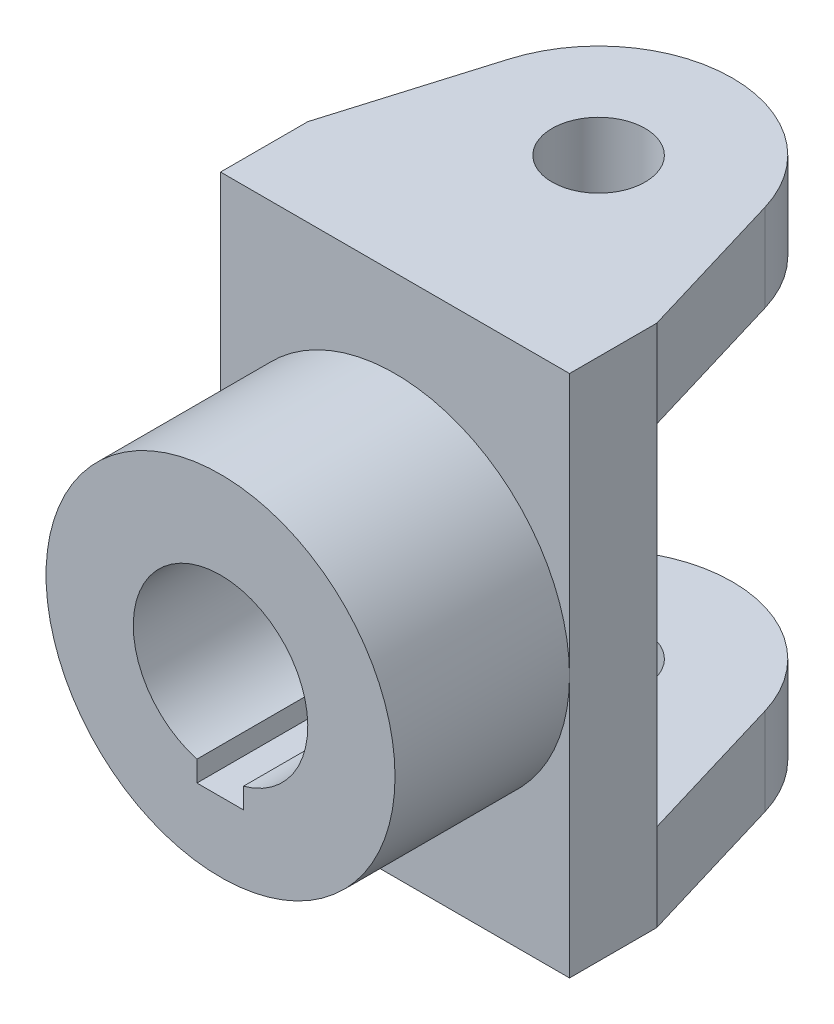
ISO-10303-21;
HEADER;
FILE_DESCRIPTION(('STEP AP214'),'2;1');
FILE_NAME('part.step','',(''),(''),'','','');
FILE_SCHEMA(('AUTOMOTIVE_DESIGN { 1 0 10303 214 1 1 1 1 }'));
ENDSEC;
DATA;
#1=APPLICATION_CONTEXT('core data for automotive mechanical design processes');
#2=APPLICATION_PROTOCOL_DEFINITION('international standard','automotive_design',2000,#1);
#3=PRODUCT_CONTEXT('',#1,'mechanical');
#4=PRODUCT('Part','Part','',(#3));
#5=PRODUCT_RELATED_PRODUCT_CATEGORY('part','',(#4));
#6=PRODUCT_DEFINITION_FORMATION('','',#4);
#7=PRODUCT_DEFINITION_CONTEXT('part definition',#1,'design');
#8=PRODUCT_DEFINITION('design','',#6,#7);
#9=PRODUCT_DEFINITION_SHAPE('','',#8);
#10=(LENGTH_UNIT() NAMED_UNIT(*) SI_UNIT(.MILLI.,.METRE.));
#11=(NAMED_UNIT(*) PLANE_ANGLE_UNIT() SI_UNIT($,.RADIAN.));
#12=(NAMED_UNIT(*) SI_UNIT($,.STERADIAN.) SOLID_ANGLE_UNIT());
#13=UNCERTAINTY_MEASURE_WITH_UNIT(LENGTH_MEASURE(1.E-05),#10,'distance_accuracy_value','');
#14=(GEOMETRIC_REPRESENTATION_CONTEXT(3) GLOBAL_UNCERTAINTY_ASSIGNED_CONTEXT((#13)) GLOBAL_UNIT_ASSIGNED_CONTEXT((#10,
#11,#12)) REPRESENTATION_CONTEXT('',''));
#15=CARTESIAN_POINT('',(0.,0.,0.));
#16=DIRECTION('',(0.,0.,1.));
#17=DIRECTION('',(1.,0.,0.));
#18=AXIS2_PLACEMENT_3D('',#15,#16,#17);
#19=CARTESIAN_POINT('',(0.,0.,0.));
#20=DIRECTION('',(0.,0.,-1.));
#21=DIRECTION('',(-1.,0.,0.));
#22=AXIS2_PLACEMENT_3D('',#19,#20,#21);
#23=PLANE('',#22);
#24=DIRECTION('',(0.,1.,0.));
#25=VECTOR('',#24,1.);
#26=CARTESIAN_POINT('',(30.,-45.,0.));
#27=LINE('',#26,#25);
#28=CARTESIAN_POINT('',(30.,-30.,0.));
#29=VERTEX_POINT('',#28);
#30=CARTESIAN_POINT('',(30.,30.,0.));
#31=VERTEX_POINT('',#30);
#32=EDGE_CURVE('E41',#29,#31,#27,.T.);
#33=ORIENTED_EDGE('',*,*,#32,.F.);
#34=DIRECTION('',(1.,0.,0.));
#35=VECTOR('',#34,1.);
#36=CARTESIAN_POINT('',(-30.,-30.,0.));
#37=LINE('',#36,#35);
#38=CARTESIAN_POINT('',(-30.,-30.,0.));
#39=VERTEX_POINT('',#38);
#40=EDGE_CURVE('E170',#39,#29,#37,.T.);
#41=ORIENTED_EDGE('',*,*,#40,.F.);
#42=DIRECTION('',(0.,-1.,0.));
#43=VECTOR('',#42,1.);
#44=CARTESIAN_POINT('',(-30.,-45.,0.));
#45=LINE('',#44,#43);
#46=CARTESIAN_POINT('',(-30.,30.,0.));
#47=VERTEX_POINT('',#46);
#48=EDGE_CURVE('E290',#47,#39,#45,.T.);
#49=ORIENTED_EDGE('',*,*,#48,.F.);
#50=DIRECTION('',(1.,0.,0.));
#51=VECTOR('',#50,1.);
#52=CARTESIAN_POINT('',(-30.,30.,0.));
#53=LINE('',#52,#51);
#54=EDGE_CURVE('E203',#47,#31,#53,.T.);
#55=ORIENTED_EDGE('',*,*,#54,.T.);
#56=EDGE_LOOP('',(#33,#41,#49,#55));
#57=FACE_BOUND('',#56,.T.);
#58=ADVANCED_FACE('F37',(#57),#23,.T.);
#59=CARTESIAN_POINT('',(0.,0.,15.));
#60=DIRECTION('',(0.,0.,-1.));
#61=DIRECTION('',(-1.,0.,0.));
#62=AXIS2_PLACEMENT_3D('',#59,#60,#61);
#63=PLANE('',#62);
#64=CARTESIAN_POINT('',(0.,0.,15.));
#65=DIRECTION('',(0.,0.,1.));
#66=DIRECTION('',(1.,0.,0.));
#67=AXIS2_PLACEMENT_3D('',#64,#65,#66);
#68=CIRCLE('',#67,30.);
#69=CARTESIAN_POINT('',(30.,0.,15.));
#70=VERTEX_POINT('',#69);
#71=CARTESIAN_POINT('',(-30.,0.,15.));
#72=VERTEX_POINT('',#71);
#73=EDGE_CURVE('E49',#70,#72,#68,.T.);
#74=ORIENTED_EDGE('',*,*,#73,.F.);
#75=DIRECTION('',(0.,1.,0.));
#76=VECTOR('',#75,1.);
#77=CARTESIAN_POINT('',(30.,-45.,15.));
#78=LINE('',#77,#76);
#79=CARTESIAN_POINT('',(30.,45.,15.));
#80=VERTEX_POINT('',#79);
#81=EDGE_CURVE('E275',#70,#80,#78,.T.);
#82=ORIENTED_EDGE('',*,*,#81,.T.);
#83=DIRECTION('',(-1.,0.,0.));
#84=VECTOR('',#83,1.);
#85=CARTESIAN_POINT('',(-30.,45.,15.));
#86=LINE('',#85,#84);
#87=CARTESIAN_POINT('',(-30.,45.,15.));
#88=VERTEX_POINT('',#87);
#89=EDGE_CURVE('E274',#80,#88,#86,.T.);
#90=ORIENTED_EDGE('',*,*,#89,.T.);
#91=DIRECTION('',(0.,-1.,0.));
#92=VECTOR('',#91,1.);
#93=CARTESIAN_POINT('',(-30.,-45.,15.));
#94=LINE('',#93,#92);
#95=EDGE_CURVE('E278',#88,#72,#94,.T.);
#96=ORIENTED_EDGE('',*,*,#95,.T.);
#97=EDGE_LOOP('',(#74,#82,#90,#96));
#98=FACE_BOUND('',#97,.T.);
#99=ADVANCED_FACE('F300',(#98),#63,.F.);
#100=EDGE_CURVE('E11',#72,#70,#68,.T.);
#101=ORIENTED_EDGE('',*,*,#100,.F.);
#102=CARTESIAN_POINT('',(-30.,-45.,15.));
#103=VERTEX_POINT('',#102);
#104=EDGE_CURVE('E277',#72,#103,#94,.T.);
#105=ORIENTED_EDGE('',*,*,#104,.T.);
#106=DIRECTION('',(1.,0.,0.));
#107=VECTOR('',#106,1.);
#108=CARTESIAN_POINT('',(-30.,-45.,15.));
#109=LINE('',#108,#107);
#110=CARTESIAN_POINT('',(30.,-45.,15.));
#111=VERTEX_POINT('',#110);
#112=EDGE_CURVE('E281',#103,#111,#109,.T.);
#113=ORIENTED_EDGE('',*,*,#112,.T.);
#114=EDGE_CURVE('E272',#111,#70,#78,.T.);
#115=ORIENTED_EDGE('',*,*,#114,.T.);
#116=EDGE_LOOP('',(#101,#105,#113,#115));
#117=FACE_BOUND('',#116,.T.);
#118=ADVANCED_FACE('F344',(#117),#63,.F.);
#119=CARTESIAN_POINT('',(30.,-45.,15.));
#120=DIRECTION('',(-1.,0.,0.));
#121=DIRECTION('',(0.,0.,1.));
#122=AXIS2_PLACEMENT_3D('',#119,#120,#121);
#123=PLANE('',#122);
#124=CARTESIAN_POINT('',(30.,-45.,0.));
#125=VERTEX_POINT('',#124);
#126=EDGE_CURVE('E288',#125,#29,#27,.T.);
#127=ORIENTED_EDGE('',*,*,#126,.T.);
#128=ORIENTED_EDGE('',*,*,#32,.T.);
#129=DIRECTION('',(0.,1.,0.));
#130=VECTOR('',#129,1.);
#131=CARTESIAN_POINT('',(30.,30.,0.));
#132=LINE('',#131,#130);
#133=CARTESIAN_POINT('',(30.,45.,0.));
#134=VERTEX_POINT('',#133);
#135=EDGE_CURVE('E216',#31,#134,#132,.T.);
#136=ORIENTED_EDGE('',*,*,#135,.T.);
#137=DIRECTION('',(0.,0.,-1.));
#138=VECTOR('',#137,1.);
#139=CARTESIAN_POINT('',(30.,45.,15.));
#140=LINE('',#139,#138);
#141=EDGE_CURVE('E47',#80,#134,#140,.T.);
#142=ORIENTED_EDGE('',*,*,#141,.F.);
#143=ORIENTED_EDGE('',*,*,#81,.F.);
#144=ORIENTED_EDGE('',*,*,#114,.F.);
#145=DIRECTION('',(0.,0.,-1.));
#146=VECTOR('',#145,1.);
#147=CARTESIAN_POINT('',(30.,-45.,15.));
#148=LINE('',#147,#146);
#149=EDGE_CURVE('E282',#111,#125,#148,.T.);
#150=ORIENTED_EDGE('',*,*,#149,.T.);
#151=EDGE_LOOP('',(#127,#128,#136,#142,#143,#144,#150));
#152=FACE_BOUND('',#151,.T.);
#153=ADVANCED_FACE('F39',(#152),#123,.F.);
#154=CARTESIAN_POINT('',(-30.,45.,15.));
#155=DIRECTION('',(0.,-1.,0.));
#156=DIRECTION('',(0.,0.,-1.));
#157=AXIS2_PLACEMENT_3D('',#154,#155,#156);
#158=PLANE('',#157);
#159=ORIENTED_EDGE('',*,*,#141,.T.);
#160=DIRECTION('',(-0.286928155857607,0.,-0.957952103905071));
#161=VECTOR('',#160,1.);
#162=CARTESIAN_POINT('',(30.,45.,0.));
#163=LINE('',#162,#161);
#164=CARTESIAN_POINT('',(22.0328983898166,45.,-26.599347584725));
#165=VERTEX_POINT('',#164);
#166=EDGE_CURVE('E228',#134,#165,#163,.T.);
#167=ORIENTED_EDGE('',*,*,#166,.T.);
#168=CARTESIAN_POINT('',(0.,45.,-20.));
#169=DIRECTION('',(0.,1.,0.));
#170=DIRECTION('',(0.,0.,1.));
#171=AXIS2_PLACEMENT_3D('',#168,#169,#170);
#172=CIRCLE('',#171,23.);
#173=CARTESIAN_POINT('',(-22.0328983898166,45.,-26.599347584725));
#174=VERTEX_POINT('',#173);
#175=EDGE_CURVE('E222',#165,#174,#172,.T.);
#176=ORIENTED_EDGE('',*,*,#175,.T.);
#177=DIRECTION('',(-0.286928155857607,0.,0.957952103905072));
#178=VECTOR('',#177,1.);
#179=CARTESIAN_POINT('',(-30.,45.,0.));
#180=LINE('',#179,#178);
#181=CARTESIAN_POINT('',(-30.,45.,0.));
#182=VERTEX_POINT('',#181);
#183=EDGE_CURVE('E195',#174,#182,#180,.T.);
#184=ORIENTED_EDGE('',*,*,#183,.T.);
#185=DIRECTION('',(0.,0.,-1.));
#186=VECTOR('',#185,1.);
#187=CARTESIAN_POINT('',(-30.,45.,15.));
#188=LINE('',#187,#186);
#189=EDGE_CURVE('E307',#88,#182,#188,.T.);
#190=ORIENTED_EDGE('',*,*,#189,.F.);
#191=ORIENTED_EDGE('',*,*,#89,.F.);
#192=EDGE_LOOP('',(#159,#167,#176,#184,#190,#191));
#193=FACE_BOUND('',#192,.T.);
#194=CARTESIAN_POINT('',(0.,45.,-20.));
#195=DIRECTION('',(0.,1.,0.));
#196=DIRECTION('',(0.,0.,1.));
#197=AXIS2_PLACEMENT_3D('',#194,#195,#196);
#198=CIRCLE('',#197,8.);
#199=CARTESIAN_POINT('',(0.,45.,-12.));
#200=VERTEX_POINT('',#199);
#201=EDGE_CURVE('E190',#200,#200,#198,.T.);
#202=ORIENTED_EDGE('',*,*,#201,.F.);
#203=EDGE_LOOP('',(#202));
#204=FACE_BOUND('',#203,.T.);
#205=ADVANCED_FACE('F305',(#193,#204),#158,.F.);
#206=CARTESIAN_POINT('',(-30.,-45.,15.));
#207=DIRECTION('',(1.,0.,0.));
#208=DIRECTION('',(0.,0.,-1.));
#209=AXIS2_PLACEMENT_3D('',#206,#207,#208);
#210=PLANE('',#209);
#211=EDGE_CURVE('E209',#182,#47,#45,.T.);
#212=ORIENTED_EDGE('',*,*,#211,.T.);
#213=ORIENTED_EDGE('',*,*,#48,.T.);
#214=DIRECTION('',(0.,-1.,0.));
#215=VECTOR('',#214,1.);
#216=CARTESIAN_POINT('',(-30.,-30.,0.));
#217=LINE('',#216,#215);
#218=CARTESIAN_POINT('',(-30.,-45.,0.));
#219=VERTEX_POINT('',#218);
#220=EDGE_CURVE('E174',#39,#219,#217,.T.);
#221=ORIENTED_EDGE('',*,*,#220,.T.);
#222=DIRECTION('',(0.,0.,-1.));
#223=VECTOR('',#222,1.);
#224=CARTESIAN_POINT('',(-30.,-45.,15.));
#225=LINE('',#224,#223);
#226=EDGE_CURVE('E310',#103,#219,#225,.T.);
#227=ORIENTED_EDGE('',*,*,#226,.F.);
#228=ORIENTED_EDGE('',*,*,#104,.F.);
#229=ORIENTED_EDGE('',*,*,#95,.F.);
#230=ORIENTED_EDGE('',*,*,#189,.T.);
#231=EDGE_LOOP('',(#212,#213,#221,#227,#228,#229,#230));
#232=FACE_BOUND('',#231,.T.);
#233=ADVANCED_FACE('F357',(#232),#210,.F.);
#234=CARTESIAN_POINT('',(-30.,-45.,15.));
#235=DIRECTION('',(0.,1.,0.));
#236=DIRECTION('',(0.,0.,1.));
#237=AXIS2_PLACEMENT_3D('',#234,#235,#236);
#238=PLANE('',#237);
#239=ORIENTED_EDGE('',*,*,#226,.T.);
#240=DIRECTION('',(-0.286928155857607,0.,0.957952103905072));
#241=VECTOR('',#240,1.);
#242=CARTESIAN_POINT('',(-30.,-45.,0.));
#243=LINE('',#242,#241);
#244=CARTESIAN_POINT('',(-22.0328983898166,-45.,-26.599347584725));
#245=VERTEX_POINT('',#244);
#246=EDGE_CURVE('E185',#245,#219,#243,.T.);
#247=ORIENTED_EDGE('',*,*,#246,.F.);
#248=CARTESIAN_POINT('',(0.,-45.,-20.));
#249=DIRECTION('',(0.,1.,0.));
#250=DIRECTION('',(0.,0.,1.));
#251=AXIS2_PLACEMENT_3D('',#248,#249,#250);
#252=CIRCLE('',#251,23.);
#253=CARTESIAN_POINT('',(22.0328983898166,-45.,-26.599347584725));
#254=VERTEX_POINT('',#253);
#255=EDGE_CURVE('E166',#254,#245,#252,.T.);
#256=ORIENTED_EDGE('',*,*,#255,.F.);
#257=DIRECTION('',(-0.286928155857607,0.,-0.957952103905071));
#258=VECTOR('',#257,1.);
#259=CARTESIAN_POINT('',(30.,-45.,0.));
#260=LINE('',#259,#258);
#261=EDGE_CURVE('E176',#125,#254,#260,.T.);
#262=ORIENTED_EDGE('',*,*,#261,.F.);
#263=ORIENTED_EDGE('',*,*,#149,.F.);
#264=ORIENTED_EDGE('',*,*,#112,.F.);
#265=EDGE_LOOP('',(#239,#247,#256,#262,#263,#264));
#266=FACE_BOUND('',#265,.T.);
#267=CARTESIAN_POINT('',(0.,-45.,-20.));
#268=DIRECTION('',(0.,1.,0.));
#269=DIRECTION('',(0.,0.,1.));
#270=AXIS2_PLACEMENT_3D('',#267,#268,#269);
#271=CIRCLE('',#270,8.);
#272=CARTESIAN_POINT('',(0.,-45.,-12.));
#273=VERTEX_POINT('',#272);
#274=EDGE_CURVE('E180',#273,#273,#271,.T.);
#275=ORIENTED_EDGE('',*,*,#274,.T.);
#276=EDGE_LOOP('',(#275));
#277=FACE_BOUND('',#276,.T.);
#278=ADVANCED_FACE('F318',(#266,#277),#238,.F.);
#279=CARTESIAN_POINT('',(0.,0.,45.));
#280=DIRECTION('',(0.,0.,1.));
#281=DIRECTION('',(1.,0.,0.));
#282=AXIS2_PLACEMENT_3D('',#279,#280,#281);
#283=PLANE('',#282);
#284=CARTESIAN_POINT('',(0.,0.,45.));
#285=DIRECTION('',(0.,0.,1.));
#286=DIRECTION('',(1.,0.,0.));
#287=AXIS2_PLACEMENT_3D('',#284,#285,#286);
#288=CIRCLE('',#287,30.);
#289=CARTESIAN_POINT('',(30.,0.,45.));
#290=VERTEX_POINT('',#289);
#291=EDGE_CURVE('E268',#290,#290,#288,.T.);
#292=ORIENTED_EDGE('',*,*,#291,.T.);
#293=EDGE_LOOP('',(#292));
#294=FACE_BOUND('',#293,.T.);
#295=DIRECTION('',(0.,1.,0.));
#296=VECTOR('',#295,1.);
#297=CARTESIAN_POINT('',(3.94187726838371,-14.4727883837566,45.));
#298=LINE('',#297,#296);
#299=CARTESIAN_POINT('',(3.94187726838371,-17.9998873911796,45.));
#300=VERTEX_POINT('',#299);
#301=CARTESIAN_POINT('',(3.94187726838371,-14.4727883837566,45.));
#302=VERTEX_POINT('',#301);
#303=EDGE_CURVE('E242',#300,#302,#298,.T.);
#304=ORIENTED_EDGE('',*,*,#303,.F.);
#305=DIRECTION('',(1.,0.,0.));
#306=VECTOR('',#305,1.);
#307=CARTESIAN_POINT('',(-4.0581227316163,-17.9998873911796,45.));
#308=LINE('',#307,#306);
#309=CARTESIAN_POINT('',(-4.0581227316163,-17.9998873911796,45.));
#310=VERTEX_POINT('',#309);
#311=EDGE_CURVE('E240',#310,#300,#308,.T.);
#312=ORIENTED_EDGE('',*,*,#311,.F.);
#313=DIRECTION('',(0.,-1.,0.));
#314=VECTOR('',#313,1.);
#315=CARTESIAN_POINT('',(-4.0581227316163,-14.4406246365986,45.));
#316=LINE('',#315,#314);
#317=CARTESIAN_POINT('',(-4.0581227316163,-14.4406246365986,45.));
#318=VERTEX_POINT('',#317);
#319=EDGE_CURVE('E248',#318,#310,#316,.T.);
#320=ORIENTED_EDGE('',*,*,#319,.F.);
#321=CARTESIAN_POINT('',(0.,0.,45.));
#322=DIRECTION('',(0.,0.,1.));
#323=DIRECTION('',(1.,0.,0.));
#324=AXIS2_PLACEMENT_3D('',#321,#322,#323);
#325=CIRCLE('',#324,15.);
#326=EDGE_CURVE('E245',#302,#318,#325,.T.);
#327=ORIENTED_EDGE('',*,*,#326,.F.);
#328=EDGE_LOOP('',(#304,#312,#320,#327));
#329=FACE_BOUND('',#328,.T.);
#330=ADVANCED_FACE('F356',(#294,#329),#283,.T.);
#331=CARTESIAN_POINT('',(0.,0.,45.));
#332=DIRECTION('',(0.,0.,-1.));
#333=DIRECTION('',(-1.,0.,0.));
#334=AXIS2_PLACEMENT_3D('',#331,#332,#333);
#335=CYLINDRICAL_SURFACE('',#334,30.);
#336=ORIENTED_EDGE('',*,*,#291,.F.);
#337=EDGE_LOOP('',(#336));
#338=FACE_BOUND('',#337,.T.);
#339=ORIENTED_EDGE('',*,*,#73,.T.);
#340=ORIENTED_EDGE('',*,*,#100,.T.);
#341=EDGE_LOOP('',(#339,#340));
#342=FACE_BOUND('',#341,.T.);
#343=ADVANCED_FACE('F372',(#338,#342),#335,.T.);
#344=CARTESIAN_POINT('',(-4.0581227316163,-17.9998873911796,45.));
#345=DIRECTION('',(0.,1.,0.));
#346=DIRECTION('',(0.,0.,1.));
#347=AXIS2_PLACEMENT_3D('',#344,#345,#346);
#348=PLANE('',#347);
#349=DIRECTION('',(1.,0.,0.));
#350=VECTOR('',#349,1.);
#351=CARTESIAN_POINT('',(-4.0581227316163,-17.9998873911796,15.));
#352=LINE('',#351,#350);
#353=CARTESIAN_POINT('',(-4.0581227316163,-17.9998873911796,15.));
#354=VERTEX_POINT('',#353);
#355=CARTESIAN_POINT('',(3.94187726838371,-17.9998873911796,15.));
#356=VERTEX_POINT('',#355);
#357=EDGE_CURVE('E238',#354,#356,#352,.T.);
#358=ORIENTED_EDGE('',*,*,#357,.F.);
#359=DIRECTION('',(0.,0.,-1.));
#360=VECTOR('',#359,1.);
#361=CARTESIAN_POINT('',(-4.0581227316163,-17.9998873911796,45.));
#362=LINE('',#361,#360);
#363=EDGE_CURVE('E63',#310,#354,#362,.T.);
#364=ORIENTED_EDGE('',*,*,#363,.F.);
#365=ORIENTED_EDGE('',*,*,#311,.T.);
#366=DIRECTION('',(0.,0.,-1.));
#367=VECTOR('',#366,1.);
#368=CARTESIAN_POINT('',(3.94187726838371,-17.9998873911796,45.));
#369=LINE('',#368,#367);
#370=EDGE_CURVE('E265',#300,#356,#369,.T.);
#371=ORIENTED_EDGE('',*,*,#370,.T.);
#372=EDGE_LOOP('',(#358,#364,#365,#371));
#373=FACE_BOUND('',#372,.T.);
#374=ADVANCED_FACE('F374',(#373),#348,.T.);
#375=CARTESIAN_POINT('',(3.94187726838371,-14.4727883837566,45.));
#376=DIRECTION('',(-1.,0.,0.));
#377=DIRECTION('',(0.,-1.,0.));
#378=AXIS2_PLACEMENT_3D('',#375,#376,#377);
#379=PLANE('',#378);
#380=DIRECTION('',(0.,1.,0.));
#381=VECTOR('',#380,1.);
#382=CARTESIAN_POINT('',(3.94187726838371,-14.4727883837566,15.));
#383=LINE('',#382,#381);
#384=CARTESIAN_POINT('',(3.94187726838371,-14.4727883837566,15.));
#385=VERTEX_POINT('',#384);
#386=EDGE_CURVE('E252',#356,#385,#383,.T.);
#387=ORIENTED_EDGE('',*,*,#386,.F.);
#388=ORIENTED_EDGE('',*,*,#370,.F.);
#389=ORIENTED_EDGE('',*,*,#303,.T.);
#390=DIRECTION('',(0.,0.,-1.));
#391=VECTOR('',#390,1.);
#392=CARTESIAN_POINT('',(3.94187726838371,-14.4727883837566,45.));
#393=LINE('',#392,#391);
#394=EDGE_CURVE('E263',#302,#385,#393,.T.);
#395=ORIENTED_EDGE('',*,*,#394,.T.);
#396=EDGE_LOOP('',(#387,#388,#389,#395));
#397=FACE_BOUND('',#396,.T.);
#398=ADVANCED_FACE('F380',(#397),#379,.T.);
#399=CARTESIAN_POINT('',(0.,0.,45.));
#400=DIRECTION('',(0.,0.,-1.));
#401=DIRECTION('',(-1.,0.,0.));
#402=AXIS2_PLACEMENT_3D('',#399,#400,#401);
#403=CYLINDRICAL_SURFACE('',#402,15.);
#404=CARTESIAN_POINT('',(0.,0.,15.));
#405=DIRECTION('',(0.,0.,1.));
#406=DIRECTION('',(1.,0.,0.));
#407=AXIS2_PLACEMENT_3D('',#404,#405,#406);
#408=CIRCLE('',#407,15.);
#409=CARTESIAN_POINT('',(-4.0581227316163,-14.4406246365986,15.));
#410=VERTEX_POINT('',#409);
#411=EDGE_CURVE('E255',#385,#410,#408,.T.);
#412=ORIENTED_EDGE('',*,*,#411,.F.);
#413=ORIENTED_EDGE('',*,*,#394,.F.);
#414=ORIENTED_EDGE('',*,*,#326,.T.);
#415=DIRECTION('',(0.,0.,-1.));
#416=VECTOR('',#415,1.);
#417=CARTESIAN_POINT('',(-4.0581227316163,-14.4406246365986,45.));
#418=LINE('',#417,#416);
#419=EDGE_CURVE('E261',#318,#410,#418,.T.);
#420=ORIENTED_EDGE('',*,*,#419,.T.);
#421=EDGE_LOOP('',(#412,#413,#414,#420));
#422=FACE_BOUND('',#421,.T.);
#423=ADVANCED_FACE('F389',(#422),#403,.F.);
#424=CARTESIAN_POINT('',(-4.0581227316163,-14.4406246365986,45.));
#425=DIRECTION('',(1.,0.,0.));
#426=DIRECTION('',(0.,1.,0.));
#427=AXIS2_PLACEMENT_3D('',#424,#425,#426);
#428=PLANE('',#427);
#429=DIRECTION('',(0.,-1.,0.));
#430=VECTOR('',#429,1.);
#431=CARTESIAN_POINT('',(-4.0581227316163,-14.4406246365986,15.));
#432=LINE('',#431,#430);
#433=EDGE_CURVE('E243',#410,#354,#432,.T.);
#434=ORIENTED_EDGE('',*,*,#433,.F.);
#435=ORIENTED_EDGE('',*,*,#419,.F.);
#436=ORIENTED_EDGE('',*,*,#319,.T.);
#437=ORIENTED_EDGE('',*,*,#363,.T.);
#438=EDGE_LOOP('',(#434,#435,#436,#437));
#439=FACE_BOUND('',#438,.T.);
#440=ADVANCED_FACE('F341',(#439),#428,.T.);
#441=ORIENTED_EDGE('',*,*,#433,.T.);
#442=ORIENTED_EDGE('',*,*,#357,.T.);
#443=ORIENTED_EDGE('',*,*,#386,.T.);
#444=ORIENTED_EDGE('',*,*,#411,.T.);
#445=EDGE_LOOP('',(#441,#442,#443,#444));
#446=FACE_BOUND('',#445,.T.);
#447=ADVANCED_FACE('F334',(#446),#63,.F.);
#448=CARTESIAN_POINT('',(-30.,30.,0.));
#449=DIRECTION('',(-0.957952103905071,0.,-0.286928155857607));
#450=DIRECTION('',(-0.286928155857607,0.,0.957952103905072));
#451=AXIS2_PLACEMENT_3D('',#448,#449,#450);
#452=PLANE('',#451);
#453=ORIENTED_EDGE('',*,*,#183,.F.);
#454=DIRECTION('',(0.,1.,0.));
#455=VECTOR('',#454,1.);
#456=CARTESIAN_POINT('',(-22.0328983898166,30.,-26.599347584725));
#457=LINE('',#456,#455);
#458=CARTESIAN_POINT('',(-22.0328983898166,30.,-26.599347584725));
#459=VERTEX_POINT('',#458);
#460=EDGE_CURVE('E236',#459,#174,#457,.T.);
#461=ORIENTED_EDGE('',*,*,#460,.F.);
#462=DIRECTION('',(-0.286928155857607,0.,0.957952103905072));
#463=VECTOR('',#462,1.);
#464=CARTESIAN_POINT('',(-30.,30.,0.));
#465=LINE('',#464,#463);
#466=EDGE_CURVE('E208',#459,#47,#465,.T.);
#467=ORIENTED_EDGE('',*,*,#466,.T.);
#468=ORIENTED_EDGE('',*,*,#211,.F.);
#469=EDGE_LOOP('',(#453,#461,#467,#468));
#470=FACE_BOUND('',#469,.T.);
#471=ADVANCED_FACE('F332',(#470),#452,.T.);
#472=CARTESIAN_POINT('',(0.,30.,-20.));
#473=DIRECTION('',(0.,1.,0.));
#474=DIRECTION('',(0.,0.,1.));
#475=AXIS2_PLACEMENT_3D('',#472,#473,#474);
#476=CYLINDRICAL_SURFACE('',#475,23.);
#477=ORIENTED_EDGE('',*,*,#175,.F.);
#478=DIRECTION('',(0.,1.,0.));
#479=VECTOR('',#478,1.);
#480=CARTESIAN_POINT('',(22.0328983898166,30.,-26.599347584725));
#481=LINE('',#480,#479);
#482=CARTESIAN_POINT('',(22.0328983898166,30.,-26.599347584725));
#483=VERTEX_POINT('',#482);
#484=EDGE_CURVE('E218',#483,#165,#481,.T.);
#485=ORIENTED_EDGE('',*,*,#484,.F.);
#486=CARTESIAN_POINT('',(0.,30.,-20.));
#487=DIRECTION('',(0.,1.,0.));
#488=DIRECTION('',(0.,0.,1.));
#489=AXIS2_PLACEMENT_3D('',#486,#487,#488);
#490=CIRCLE('',#489,23.);
#491=EDGE_CURVE('E200',#483,#459,#490,.T.);
#492=ORIENTED_EDGE('',*,*,#491,.T.);
#493=ORIENTED_EDGE('',*,*,#460,.T.);
#494=EDGE_LOOP('',(#477,#485,#492,#493));
#495=FACE_BOUND('',#494,.T.);
#496=ADVANCED_FACE('F330',(#495),#476,.T.);
#497=CARTESIAN_POINT('',(30.,30.,0.));
#498=DIRECTION('',(0.957952103905071,0.,-0.286928155857607));
#499=DIRECTION('',(-0.286928155857607,0.,-0.957952103905072));
#500=AXIS2_PLACEMENT_3D('',#497,#498,#499);
#501=PLANE('',#500);
#502=ORIENTED_EDGE('',*,*,#166,.F.);
#503=ORIENTED_EDGE('',*,*,#135,.F.);
#504=DIRECTION('',(-0.286928155857607,0.,-0.957952103905071));
#505=VECTOR('',#504,1.);
#506=CARTESIAN_POINT('',(30.,30.,0.));
#507=LINE('',#506,#505);
#508=EDGE_CURVE('E207',#31,#483,#507,.T.);
#509=ORIENTED_EDGE('',*,*,#508,.T.);
#510=ORIENTED_EDGE('',*,*,#484,.T.);
#511=EDGE_LOOP('',(#502,#503,#509,#510));
#512=FACE_BOUND('',#511,.T.);
#513=ADVANCED_FACE('F328',(#512),#501,.T.);
#514=CARTESIAN_POINT('',(0.,30.,-20.));
#515=DIRECTION('',(0.,1.,0.));
#516=DIRECTION('',(0.,0.,1.));
#517=AXIS2_PLACEMENT_3D('',#514,#515,#516);
#518=PLANE('',#517);
#519=CARTESIAN_POINT('',(0.,30.,-20.));
#520=DIRECTION('',(0.,1.,0.));
#521=DIRECTION('',(0.,0.,1.));
#522=AXIS2_PLACEMENT_3D('',#519,#520,#521);
#523=CIRCLE('',#522,8.);
#524=CARTESIAN_POINT('',(0.,30.,-12.));
#525=VERTEX_POINT('',#524);
#526=EDGE_CURVE('E192',#525,#525,#523,.T.);
#527=ORIENTED_EDGE('',*,*,#526,.T.);
#528=EDGE_LOOP('',(#527));
#529=FACE_BOUND('',#528,.T.);
#530=ORIENTED_EDGE('',*,*,#466,.F.);
#531=ORIENTED_EDGE('',*,*,#491,.F.);
#532=ORIENTED_EDGE('',*,*,#508,.F.);
#533=ORIENTED_EDGE('',*,*,#54,.F.);
#534=EDGE_LOOP('',(#530,#531,#532,#533));
#535=FACE_BOUND('',#534,.T.);
#536=ADVANCED_FACE('F324',(#529,#535),#518,.F.);
#537=CARTESIAN_POINT('',(0.,30.,-20.));
#538=DIRECTION('',(0.,1.,0.));
#539=DIRECTION('',(0.,0.,1.));
#540=AXIS2_PLACEMENT_3D('',#537,#538,#539);
#541=CYLINDRICAL_SURFACE('',#540,8.);
#542=ORIENTED_EDGE('',*,*,#526,.F.);
#543=EDGE_LOOP('',(#542));
#544=FACE_BOUND('',#543,.T.);
#545=ORIENTED_EDGE('',*,*,#201,.T.);
#546=EDGE_LOOP('',(#545));
#547=FACE_BOUND('',#546,.T.);
#548=ADVANCED_FACE('F443',(#544,#547),#541,.F.);
#549=CARTESIAN_POINT('',(0.,-30.,-20.));
#550=DIRECTION('',(0.,-1.,0.));
#551=DIRECTION('',(0.,0.,1.));
#552=AXIS2_PLACEMENT_3D('',#549,#550,#551);
#553=PLANE('',#552);
#554=DIRECTION('',(-0.286928155857607,0.,0.957952103905072));
#555=VECTOR('',#554,1.);
#556=CARTESIAN_POINT('',(-30.,-30.,0.));
#557=LINE('',#556,#555);
#558=CARTESIAN_POINT('',(-22.0328983898166,-30.,-26.599347584725));
#559=VERTEX_POINT('',#558);
#560=EDGE_CURVE('E154',#559,#39,#557,.T.);
#561=ORIENTED_EDGE('',*,*,#560,.T.);
#562=ORIENTED_EDGE('',*,*,#40,.T.);
#563=DIRECTION('',(-0.286928155857607,0.,-0.957952103905071));
#564=VECTOR('',#563,1.);
#565=CARTESIAN_POINT('',(30.,-30.,0.));
#566=LINE('',#565,#564);
#567=CARTESIAN_POINT('',(22.0328983898166,-30.,-26.599347584725));
#568=VERTEX_POINT('',#567);
#569=EDGE_CURVE('E157',#29,#568,#566,.T.);
#570=ORIENTED_EDGE('',*,*,#569,.T.);
#571=CARTESIAN_POINT('',(0.,-30.,-20.));
#572=DIRECTION('',(0.,1.,0.));
#573=DIRECTION('',(0.,0.,1.));
#574=AXIS2_PLACEMENT_3D('',#571,#572,#573);
#575=CIRCLE('',#574,23.);
#576=EDGE_CURVE('E149',#568,#559,#575,.T.);
#577=ORIENTED_EDGE('',*,*,#576,.T.);
#578=EDGE_LOOP('',(#561,#562,#570,#577));
#579=FACE_BOUND('',#578,.T.);
#580=CARTESIAN_POINT('',(0.,-30.,-20.));
#581=DIRECTION('',(0.,1.,0.));
#582=DIRECTION('',(0.,0.,1.));
#583=AXIS2_PLACEMENT_3D('',#580,#581,#582);
#584=CIRCLE('',#583,8.);
#585=CARTESIAN_POINT('',(0.,-30.,-12.));
#586=VERTEX_POINT('',#585);
#587=EDGE_CURVE('E187',#586,#586,#584,.T.);
#588=ORIENTED_EDGE('',*,*,#587,.F.);
#589=EDGE_LOOP('',(#588));
#590=FACE_BOUND('',#589,.T.);
#591=ADVANCED_FACE('F151',(#579,#590),#553,.F.);
#592=CARTESIAN_POINT('',(-30.,-30.,0.));
#593=DIRECTION('',(0.957952103905071,0.,0.286928155857607));
#594=DIRECTION('',(0.286928155857607,0.,-0.957952103905072));
#595=AXIS2_PLACEMENT_3D('',#592,#593,#594);
#596=PLANE('',#595);
#597=ORIENTED_EDGE('',*,*,#246,.T.);
#598=ORIENTED_EDGE('',*,*,#220,.F.);
#599=ORIENTED_EDGE('',*,*,#560,.F.);
#600=DIRECTION('',(0.,-1.,0.));
#601=VECTOR('',#600,1.);
#602=CARTESIAN_POINT('',(-22.0328983898166,-30.,-26.599347584725));
#603=LINE('',#602,#601);
#604=EDGE_CURVE('E163',#559,#245,#603,.T.);
#605=ORIENTED_EDGE('',*,*,#604,.T.);
#606=EDGE_LOOP('',(#597,#598,#599,#605));
#607=FACE_BOUND('',#606,.T.);
#608=ADVANCED_FACE('F172',(#607),#596,.F.);
#609=CARTESIAN_POINT('',(30.,-30.,0.));
#610=DIRECTION('',(-0.957952103905071,0.,0.286928155857607));
#611=DIRECTION('',(0.286928155857607,0.,0.957952103905072));
#612=AXIS2_PLACEMENT_3D('',#609,#610,#611);
#613=PLANE('',#612);
#614=ORIENTED_EDGE('',*,*,#261,.T.);
#615=DIRECTION('',(0.,-1.,0.));
#616=VECTOR('',#615,1.);
#617=CARTESIAN_POINT('',(22.0328983898166,-30.,-26.599347584725));
#618=LINE('',#617,#616);
#619=EDGE_CURVE('E169',#568,#254,#618,.T.);
#620=ORIENTED_EDGE('',*,*,#619,.F.);
#621=ORIENTED_EDGE('',*,*,#569,.F.);
#622=ORIENTED_EDGE('',*,*,#126,.F.);
#623=EDGE_LOOP('',(#614,#620,#621,#622));
#624=FACE_BOUND('',#623,.T.);
#625=ADVANCED_FACE('F321',(#624),#613,.F.);
#626=CARTESIAN_POINT('',(0.,-30.,-20.));
#627=DIRECTION('',(0.,-1.,0.));
#628=DIRECTION('',(0.,0.,-1.));
#629=AXIS2_PLACEMENT_3D('',#626,#627,#628);
#630=CYLINDRICAL_SURFACE('',#629,23.);
#631=ORIENTED_EDGE('',*,*,#255,.T.);
#632=ORIENTED_EDGE('',*,*,#604,.F.);
#633=ORIENTED_EDGE('',*,*,#576,.F.);
#634=ORIENTED_EDGE('',*,*,#619,.T.);
#635=EDGE_LOOP('',(#631,#632,#633,#634));
#636=FACE_BOUND('',#635,.T.);
#637=ADVANCED_FACE('F164',(#636),#630,.T.);
#638=CARTESIAN_POINT('',(0.,-30.,-20.));
#639=DIRECTION('',(0.,-1.,0.));
#640=DIRECTION('',(0.,0.,-1.));
#641=AXIS2_PLACEMENT_3D('',#638,#639,#640);
#642=CYLINDRICAL_SURFACE('',#641,8.);
#643=ORIENTED_EDGE('',*,*,#587,.T.);
#644=EDGE_LOOP('',(#643));
#645=FACE_BOUND('',#644,.T.);
#646=ORIENTED_EDGE('',*,*,#274,.F.);
#647=EDGE_LOOP('',(#646));
#648=FACE_BOUND('',#647,.T.);
#649=ADVANCED_FACE('F506',(#645,#648),#642,.F.);
#650=CLOSED_SHELL('',(#58,#99,#118,#153,#205,#233,#278,#330,#343,#374,#398,#423,#440,#447,#471,
#496,#513,#536,#548,#591,#608,#625,#637,#649));
#651=MANIFOLD_SOLID_BREP('B2',#650);
#652=ADVANCED_BREP_SHAPE_REPRESENTATION('',(#18,#651),#14);
#653=SHAPE_DEFINITION_REPRESENTATION(#9,#652);
ENDSEC;
END-ISO-10303-21;
